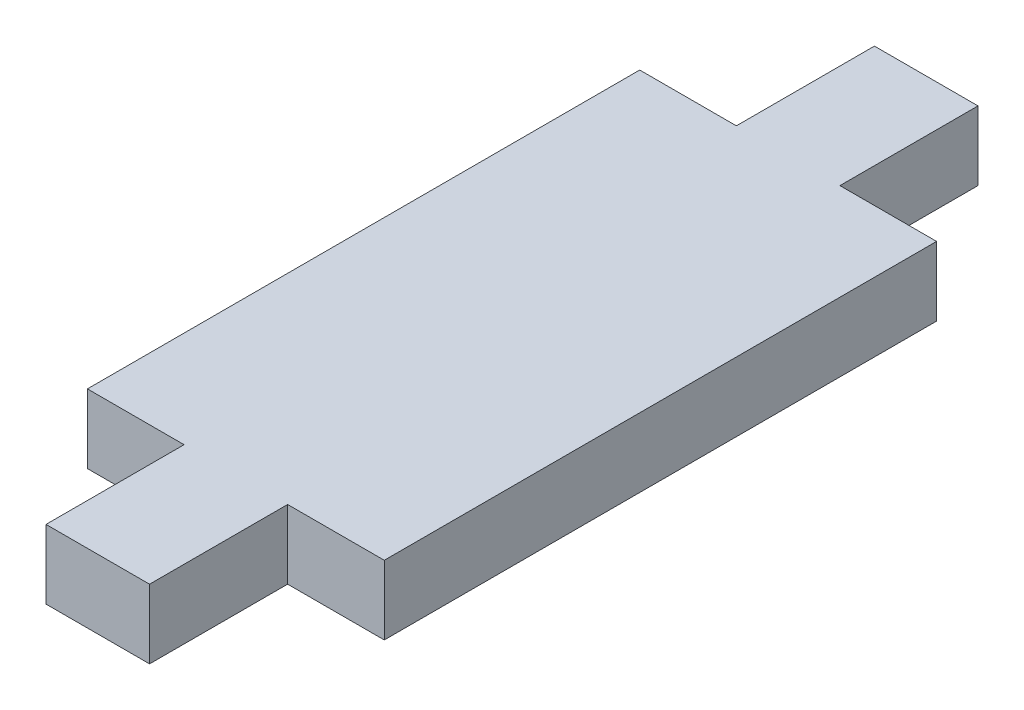
ISO-10303-21;
HEADER;
FILE_DESCRIPTION(('STEP AP214'),'2;1');
FILE_NAME('part.step','',(''),(''),'','','');
FILE_SCHEMA(('AUTOMOTIVE_DESIGN { 1 0 10303 214 1 1 1 1 }'));
ENDSEC;
DATA;
#1=APPLICATION_CONTEXT('core data for automotive mechanical design processes');
#2=APPLICATION_PROTOCOL_DEFINITION('international standard','automotive_design',2000,#1);
#3=PRODUCT_CONTEXT('',#1,'mechanical');
#4=PRODUCT('Part','Part','',(#3));
#5=PRODUCT_RELATED_PRODUCT_CATEGORY('part','',(#4));
#6=PRODUCT_DEFINITION_FORMATION('','',#4);
#7=PRODUCT_DEFINITION_CONTEXT('part definition',#1,'design');
#8=PRODUCT_DEFINITION('design','',#6,#7);
#9=PRODUCT_DEFINITION_SHAPE('','',#8);
#10=(LENGTH_UNIT() NAMED_UNIT(*) SI_UNIT(.MILLI.,.METRE.));
#11=(NAMED_UNIT(*) PLANE_ANGLE_UNIT() SI_UNIT($,.RADIAN.));
#12=(NAMED_UNIT(*) SI_UNIT($,.STERADIAN.) SOLID_ANGLE_UNIT());
#13=UNCERTAINTY_MEASURE_WITH_UNIT(LENGTH_MEASURE(1.E-05),#10,'distance_accuracy_value','');
#14=(GEOMETRIC_REPRESENTATION_CONTEXT(3) GLOBAL_UNCERTAINTY_ASSIGNED_CONTEXT((#13)) GLOBAL_UNIT_ASSIGNED_CONTEXT((#10,
#11,#12)) REPRESENTATION_CONTEXT('',''));
#15=CARTESIAN_POINT('',(0.,0.,0.));
#16=DIRECTION('',(0.,0.,1.));
#17=DIRECTION('',(1.,0.,0.));
#18=AXIS2_PLACEMENT_3D('',#15,#16,#17);
#19=CARTESIAN_POINT('',(3.75,5.,20.));
#20=DIRECTION('',(0.,0.,-1.));
#21=DIRECTION('',(-1.,0.,0.));
#22=AXIS2_PLACEMENT_3D('',#19,#20,#21);
#23=PLANE('',#22);
#24=DIRECTION('',(1.,0.,0.));
#25=VECTOR('',#24,1.);
#26=CARTESIAN_POINT('',(3.75,0.,20.));
#27=LINE('',#26,#25);
#28=CARTESIAN_POINT('',(3.75,0.,20.));
#29=VERTEX_POINT('',#28);
#30=CARTESIAN_POINT('',(10.75,0.,20.));
#31=VERTEX_POINT('',#30);
#32=EDGE_CURVE('E164',#29,#31,#27,.T.);
#33=ORIENTED_EDGE('',*,*,#32,.T.);
#34=DIRECTION('',(0.,-1.,0.));
#35=VECTOR('',#34,1.);
#36=CARTESIAN_POINT('',(10.75,5.,20.));
#37=LINE('',#36,#35);
#38=CARTESIAN_POINT('',(10.75,5.,20.));
#39=VERTEX_POINT('',#38);
#40=EDGE_CURVE('E11',#39,#31,#37,.T.);
#41=ORIENTED_EDGE('',*,*,#40,.F.);
#42=DIRECTION('',(1.,0.,0.));
#43=VECTOR('',#42,1.);
#44=CARTESIAN_POINT('',(3.75,5.,20.));
#45=LINE('',#44,#43);
#46=CARTESIAN_POINT('',(3.75,5.,20.));
#47=VERTEX_POINT('',#46);
#48=EDGE_CURVE('E198',#47,#39,#45,.T.);
#49=ORIENTED_EDGE('',*,*,#48,.F.);
#50=DIRECTION('',(0.,-1.,0.));
#51=VECTOR('',#50,1.);
#52=CARTESIAN_POINT('',(3.75,5.,20.));
#53=LINE('',#52,#51);
#54=EDGE_CURVE('E160',#47,#29,#53,.T.);
#55=ORIENTED_EDGE('',*,*,#54,.T.);
#56=EDGE_LOOP('',(#33,#41,#49,#55));
#57=FACE_BOUND('',#56,.T.);
#58=ADVANCED_FACE('F39',(#57),#23,.F.);
#59=CARTESIAN_POINT('',(10.75,5.,-20.));
#60=DIRECTION('',(-1.,0.,0.));
#61=DIRECTION('',(0.,0.,1.));
#62=AXIS2_PLACEMENT_3D('',#59,#60,#61);
#63=PLANE('',#62);
#64=DIRECTION('',(0.,0.,-1.));
#65=VECTOR('',#64,1.);
#66=CARTESIAN_POINT('',(10.75,0.,-20.));
#67=LINE('',#66,#65);
#68=CARTESIAN_POINT('',(10.75,0.,-20.));
#69=VERTEX_POINT('',#68);
#70=EDGE_CURVE('E168',#31,#69,#67,.T.);
#71=ORIENTED_EDGE('',*,*,#70,.T.);
#72=DIRECTION('',(0.,-1.,0.));
#73=VECTOR('',#72,1.);
#74=CARTESIAN_POINT('',(10.75,5.,-20.));
#75=LINE('',#74,#73);
#76=CARTESIAN_POINT('',(10.75,5.,-20.));
#77=VERTEX_POINT('',#76);
#78=EDGE_CURVE('E48',#77,#69,#75,.T.);
#79=ORIENTED_EDGE('',*,*,#78,.F.);
#80=DIRECTION('',(0.,0.,-1.));
#81=VECTOR('',#80,1.);
#82=CARTESIAN_POINT('',(10.75,5.,-20.));
#83=LINE('',#82,#81);
#84=EDGE_CURVE('E111',#39,#77,#83,.T.);
#85=ORIENTED_EDGE('',*,*,#84,.F.);
#86=ORIENTED_EDGE('',*,*,#40,.T.);
#87=EDGE_LOOP('',(#71,#79,#85,#86));
#88=FACE_BOUND('',#87,.T.);
#89=ADVANCED_FACE('F292',(#88),#63,.F.);
#90=CARTESIAN_POINT('',(3.75,5.,-20.));
#91=DIRECTION('',(0.,0.,1.));
#92=DIRECTION('',(1.,0.,0.));
#93=AXIS2_PLACEMENT_3D('',#90,#91,#92);
#94=PLANE('',#93);
#95=DIRECTION('',(-1.,0.,0.));
#96=VECTOR('',#95,1.);
#97=CARTESIAN_POINT('',(3.75,0.,-20.));
#98=LINE('',#97,#96);
#99=CARTESIAN_POINT('',(3.75,0.,-20.));
#100=VERTEX_POINT('',#99);
#101=EDGE_CURVE('E171',#69,#100,#98,.T.);
#102=ORIENTED_EDGE('',*,*,#101,.T.);
#103=DIRECTION('',(0.,-1.,0.));
#104=VECTOR('',#103,1.);
#105=CARTESIAN_POINT('',(3.75,5.,-20.));
#106=LINE('',#105,#104);
#107=CARTESIAN_POINT('',(3.75,5.,-20.));
#108=VERTEX_POINT('',#107);
#109=EDGE_CURVE('E225',#108,#100,#106,.T.);
#110=ORIENTED_EDGE('',*,*,#109,.F.);
#111=DIRECTION('',(-1.,0.,0.));
#112=VECTOR('',#111,1.);
#113=CARTESIAN_POINT('',(3.75,5.,-20.));
#114=LINE('',#113,#112);
#115=EDGE_CURVE('E235',#77,#108,#114,.T.);
#116=ORIENTED_EDGE('',*,*,#115,.F.);
#117=ORIENTED_EDGE('',*,*,#78,.T.);
#118=EDGE_LOOP('',(#102,#110,#116,#117));
#119=FACE_BOUND('',#118,.T.);
#120=ADVANCED_FACE('F233',(#119),#94,.F.);
#121=CARTESIAN_POINT('',(3.75,5.,-30.));
#122=DIRECTION('',(-1.,0.,0.));
#123=DIRECTION('',(0.,0.,1.));
#124=AXIS2_PLACEMENT_3D('',#121,#122,#123);
#125=PLANE('',#124);
#126=DIRECTION('',(0.,0.,-1.));
#127=VECTOR('',#126,1.);
#128=CARTESIAN_POINT('',(3.75,0.,-30.));
#129=LINE('',#128,#127);
#130=CARTESIAN_POINT('',(3.75,0.,-30.));
#131=VERTEX_POINT('',#130);
#132=EDGE_CURVE('E174',#100,#131,#129,.T.);
#133=ORIENTED_EDGE('',*,*,#132,.T.);
#134=DIRECTION('',(0.,-1.,0.));
#135=VECTOR('',#134,1.);
#136=CARTESIAN_POINT('',(3.75,5.,-30.));
#137=LINE('',#136,#135);
#138=CARTESIAN_POINT('',(3.75,5.,-30.));
#139=VERTEX_POINT('',#138);
#140=EDGE_CURVE('E221',#139,#131,#137,.T.);
#141=ORIENTED_EDGE('',*,*,#140,.F.);
#142=DIRECTION('',(0.,0.,-1.));
#143=VECTOR('',#142,1.);
#144=CARTESIAN_POINT('',(3.75,5.,-30.));
#145=LINE('',#144,#143);
#146=EDGE_CURVE('E254',#108,#139,#145,.T.);
#147=ORIENTED_EDGE('',*,*,#146,.F.);
#148=ORIENTED_EDGE('',*,*,#109,.T.);
#149=EDGE_LOOP('',(#133,#141,#147,#148));
#150=FACE_BOUND('',#149,.T.);
#151=ADVANCED_FACE('F244',(#150),#125,.F.);
#152=CARTESIAN_POINT('',(-3.75,5.,-30.));
#153=DIRECTION('',(0.,0.,1.));
#154=DIRECTION('',(1.,0.,0.));
#155=AXIS2_PLACEMENT_3D('',#152,#153,#154);
#156=PLANE('',#155);
#157=DIRECTION('',(-1.,0.,0.));
#158=VECTOR('',#157,1.);
#159=CARTESIAN_POINT('',(-3.75,0.,-30.));
#160=LINE('',#159,#158);
#161=CARTESIAN_POINT('',(-3.75,0.,-30.));
#162=VERTEX_POINT('',#161);
#163=EDGE_CURVE('E177',#131,#162,#160,.T.);
#164=ORIENTED_EDGE('',*,*,#163,.T.);
#165=DIRECTION('',(0.,-1.,0.));
#166=VECTOR('',#165,1.);
#167=CARTESIAN_POINT('',(-3.75,5.,-30.));
#168=LINE('',#167,#166);
#169=CARTESIAN_POINT('',(-3.75,5.,-30.));
#170=VERTEX_POINT('',#169);
#171=EDGE_CURVE('E217',#170,#162,#168,.T.);
#172=ORIENTED_EDGE('',*,*,#171,.F.);
#173=DIRECTION('',(-1.,0.,0.));
#174=VECTOR('',#173,1.);
#175=CARTESIAN_POINT('',(-3.75,5.,-30.));
#176=LINE('',#175,#174);
#177=EDGE_CURVE('E250',#139,#170,#176,.T.);
#178=ORIENTED_EDGE('',*,*,#177,.F.);
#179=ORIENTED_EDGE('',*,*,#140,.T.);
#180=EDGE_LOOP('',(#164,#172,#178,#179));
#181=FACE_BOUND('',#180,.T.);
#182=ADVANCED_FACE('F248',(#181),#156,.F.);
#183=CARTESIAN_POINT('',(-3.75,5.,-30.));
#184=DIRECTION('',(1.,0.,0.));
#185=DIRECTION('',(0.,0.,-1.));
#186=AXIS2_PLACEMENT_3D('',#183,#184,#185);
#187=PLANE('',#186);
#188=DIRECTION('',(0.,0.,1.));
#189=VECTOR('',#188,1.);
#190=CARTESIAN_POINT('',(-3.75,0.,-30.));
#191=LINE('',#190,#189);
#192=CARTESIAN_POINT('',(-3.75,0.,-20.));
#193=VERTEX_POINT('',#192);
#194=EDGE_CURVE('E180',#162,#193,#191,.T.);
#195=ORIENTED_EDGE('',*,*,#194,.T.);
#196=DIRECTION('',(0.,-1.,0.));
#197=VECTOR('',#196,1.);
#198=CARTESIAN_POINT('',(-3.75,5.,-20.));
#199=LINE('',#198,#197);
#200=CARTESIAN_POINT('',(-3.75,5.,-20.));
#201=VERTEX_POINT('',#200);
#202=EDGE_CURVE('E213',#201,#193,#199,.T.);
#203=ORIENTED_EDGE('',*,*,#202,.F.);
#204=DIRECTION('',(0.,0.,1.));
#205=VECTOR('',#204,1.);
#206=CARTESIAN_POINT('',(-3.75,5.,-30.));
#207=LINE('',#206,#205);
#208=EDGE_CURVE('E253',#170,#201,#207,.T.);
#209=ORIENTED_EDGE('',*,*,#208,.F.);
#210=ORIENTED_EDGE('',*,*,#171,.T.);
#211=EDGE_LOOP('',(#195,#203,#209,#210));
#212=FACE_BOUND('',#211,.T.);
#213=ADVANCED_FACE('F305',(#212),#187,.F.);
#214=CARTESIAN_POINT('',(-10.75,5.,-20.));
#215=DIRECTION('',(0.,0.,1.));
#216=DIRECTION('',(1.,0.,0.));
#217=AXIS2_PLACEMENT_3D('',#214,#215,#216);
#218=PLANE('',#217);
#219=DIRECTION('',(-1.,0.,0.));
#220=VECTOR('',#219,1.);
#221=CARTESIAN_POINT('',(-10.75,0.,-20.));
#222=LINE('',#221,#220);
#223=CARTESIAN_POINT('',(-10.75,0.,-20.));
#224=VERTEX_POINT('',#223);
#225=EDGE_CURVE('E183',#193,#224,#222,.T.);
#226=ORIENTED_EDGE('',*,*,#225,.T.);
#227=DIRECTION('',(0.,-1.,0.));
#228=VECTOR('',#227,1.);
#229=CARTESIAN_POINT('',(-10.75,5.,-20.));
#230=LINE('',#229,#228);
#231=CARTESIAN_POINT('',(-10.75,5.,-20.));
#232=VERTEX_POINT('',#231);
#233=EDGE_CURVE('E209',#232,#224,#230,.T.);
#234=ORIENTED_EDGE('',*,*,#233,.F.);
#235=DIRECTION('',(-1.,0.,0.));
#236=VECTOR('',#235,1.);
#237=CARTESIAN_POINT('',(-10.75,5.,-20.));
#238=LINE('',#237,#236);
#239=EDGE_CURVE('E258',#201,#232,#238,.T.);
#240=ORIENTED_EDGE('',*,*,#239,.F.);
#241=ORIENTED_EDGE('',*,*,#202,.T.);
#242=EDGE_LOOP('',(#226,#234,#240,#241));
#243=FACE_BOUND('',#242,.T.);
#244=ADVANCED_FACE('F308',(#243),#218,.F.);
#245=CARTESIAN_POINT('',(-10.75,5.,-20.));
#246=DIRECTION('',(1.,0.,0.));
#247=DIRECTION('',(0.,0.,-1.));
#248=AXIS2_PLACEMENT_3D('',#245,#246,#247);
#249=PLANE('',#248);
#250=DIRECTION('',(0.,0.,1.));
#251=VECTOR('',#250,1.);
#252=CARTESIAN_POINT('',(-10.75,0.,-20.));
#253=LINE('',#252,#251);
#254=CARTESIAN_POINT('',(-10.75,0.,20.));
#255=VERTEX_POINT('',#254);
#256=EDGE_CURVE('E186',#224,#255,#253,.T.);
#257=ORIENTED_EDGE('',*,*,#256,.T.);
#258=DIRECTION('',(0.,-1.,0.));
#259=VECTOR('',#258,1.);
#260=CARTESIAN_POINT('',(-10.75,5.,20.));
#261=LINE('',#260,#259);
#262=CARTESIAN_POINT('',(-10.75,5.,20.));
#263=VERTEX_POINT('',#262);
#264=EDGE_CURVE('E205',#263,#255,#261,.T.);
#265=ORIENTED_EDGE('',*,*,#264,.F.);
#266=DIRECTION('',(0.,0.,1.));
#267=VECTOR('',#266,1.);
#268=CARTESIAN_POINT('',(-10.75,5.,-20.));
#269=LINE('',#268,#267);
#270=EDGE_CURVE('E265',#232,#263,#269,.T.);
#271=ORIENTED_EDGE('',*,*,#270,.F.);
#272=ORIENTED_EDGE('',*,*,#233,.T.);
#273=EDGE_LOOP('',(#257,#265,#271,#272));
#274=FACE_BOUND('',#273,.T.);
#275=ADVANCED_FACE('F273',(#274),#249,.F.);
#276=CARTESIAN_POINT('',(-10.75,5.,20.));
#277=DIRECTION('',(0.,0.,-1.));
#278=DIRECTION('',(-1.,0.,0.));
#279=AXIS2_PLACEMENT_3D('',#276,#277,#278);
#280=PLANE('',#279);
#281=DIRECTION('',(1.,0.,0.));
#282=VECTOR('',#281,1.);
#283=CARTESIAN_POINT('',(-10.75,0.,20.));
#284=LINE('',#283,#282);
#285=CARTESIAN_POINT('',(-3.75,0.,20.));
#286=VERTEX_POINT('',#285);
#287=EDGE_CURVE('E189',#255,#286,#284,.T.);
#288=ORIENTED_EDGE('',*,*,#287,.T.);
#289=DIRECTION('',(0.,-1.,0.));
#290=VECTOR('',#289,1.);
#291=CARTESIAN_POINT('',(-3.75,5.,20.));
#292=LINE('',#291,#290);
#293=CARTESIAN_POINT('',(-3.75,5.,20.));
#294=VERTEX_POINT('',#293);
#295=EDGE_CURVE('E153',#294,#286,#292,.T.);
#296=ORIENTED_EDGE('',*,*,#295,.F.);
#297=DIRECTION('',(1.,0.,0.));
#298=VECTOR('',#297,1.);
#299=CARTESIAN_POINT('',(-10.75,5.,20.));
#300=LINE('',#299,#298);
#301=EDGE_CURVE('E142',#263,#294,#300,.T.);
#302=ORIENTED_EDGE('',*,*,#301,.F.);
#303=ORIENTED_EDGE('',*,*,#264,.T.);
#304=EDGE_LOOP('',(#288,#296,#302,#303));
#305=FACE_BOUND('',#304,.T.);
#306=ADVANCED_FACE('F277',(#305),#280,.F.);
#307=CARTESIAN_POINT('',(-3.75,5.,30.));
#308=DIRECTION('',(1.,0.,0.));
#309=DIRECTION('',(0.,0.,-1.));
#310=AXIS2_PLACEMENT_3D('',#307,#308,#309);
#311=PLANE('',#310);
#312=DIRECTION('',(0.,0.,1.));
#313=VECTOR('',#312,1.);
#314=CARTESIAN_POINT('',(-3.75,0.,30.));
#315=LINE('',#314,#313);
#316=CARTESIAN_POINT('',(-3.75,0.,30.));
#317=VERTEX_POINT('',#316);
#318=EDGE_CURVE('E151',#286,#317,#315,.T.);
#319=ORIENTED_EDGE('',*,*,#318,.T.);
#320=DIRECTION('',(0.,-1.,0.));
#321=VECTOR('',#320,1.);
#322=CARTESIAN_POINT('',(-3.75,5.,30.));
#323=LINE('',#322,#321);
#324=CARTESIAN_POINT('',(-3.75,5.,30.));
#325=VERTEX_POINT('',#324);
#326=EDGE_CURVE('E148',#325,#317,#323,.T.);
#327=ORIENTED_EDGE('',*,*,#326,.F.);
#328=DIRECTION('',(0.,0.,1.));
#329=VECTOR('',#328,1.);
#330=CARTESIAN_POINT('',(-3.75,5.,30.));
#331=LINE('',#330,#329);
#332=EDGE_CURVE('E136',#294,#325,#331,.T.);
#333=ORIENTED_EDGE('',*,*,#332,.F.);
#334=ORIENTED_EDGE('',*,*,#295,.T.);
#335=EDGE_LOOP('',(#319,#327,#333,#334));
#336=FACE_BOUND('',#335,.T.);
#337=ADVANCED_FACE('F149',(#336),#311,.F.);
#338=CARTESIAN_POINT('',(-3.75,5.,30.));
#339=DIRECTION('',(0.,0.,-1.));
#340=DIRECTION('',(-1.,0.,0.));
#341=AXIS2_PLACEMENT_3D('',#338,#339,#340);
#342=PLANE('',#341);
#343=DIRECTION('',(1.,0.,0.));
#344=VECTOR('',#343,1.);
#345=CARTESIAN_POINT('',(-3.75,0.,30.));
#346=LINE('',#345,#344);
#347=CARTESIAN_POINT('',(3.75,0.,30.));
#348=VERTEX_POINT('',#347);
#349=EDGE_CURVE('E97',#317,#348,#346,.T.);
#350=ORIENTED_EDGE('',*,*,#349,.T.);
#351=DIRECTION('',(0.,-1.,0.));
#352=VECTOR('',#351,1.);
#353=CARTESIAN_POINT('',(3.75,5.,30.));
#354=LINE('',#353,#352);
#355=CARTESIAN_POINT('',(3.75,5.,30.));
#356=VERTEX_POINT('',#355);
#357=EDGE_CURVE('E154',#356,#348,#354,.T.);
#358=ORIENTED_EDGE('',*,*,#357,.F.);
#359=DIRECTION('',(1.,0.,0.));
#360=VECTOR('',#359,1.);
#361=CARTESIAN_POINT('',(-3.75,5.,30.));
#362=LINE('',#361,#360);
#363=EDGE_CURVE('E140',#325,#356,#362,.T.);
#364=ORIENTED_EDGE('',*,*,#363,.F.);
#365=ORIENTED_EDGE('',*,*,#326,.T.);
#366=EDGE_LOOP('',(#350,#358,#364,#365));
#367=FACE_BOUND('',#366,.T.);
#368=ADVANCED_FACE('F156',(#367),#342,.F.);
#369=CARTESIAN_POINT('',(3.75,5.,30.));
#370=DIRECTION('',(-1.,0.,0.));
#371=DIRECTION('',(0.,0.,1.));
#372=AXIS2_PLACEMENT_3D('',#369,#370,#371);
#373=PLANE('',#372);
#374=DIRECTION('',(0.,0.,-1.));
#375=VECTOR('',#374,1.);
#376=CARTESIAN_POINT('',(3.75,0.,30.));
#377=LINE('',#376,#375);
#378=EDGE_CURVE('E103',#348,#29,#377,.T.);
#379=ORIENTED_EDGE('',*,*,#378,.T.);
#380=ORIENTED_EDGE('',*,*,#54,.F.);
#381=DIRECTION('',(0.,0.,-1.));
#382=VECTOR('',#381,1.);
#383=CARTESIAN_POINT('',(3.75,5.,30.));
#384=LINE('',#383,#382);
#385=EDGE_CURVE('E56',#356,#47,#384,.T.);
#386=ORIENTED_EDGE('',*,*,#385,.F.);
#387=ORIENTED_EDGE('',*,*,#357,.T.);
#388=EDGE_LOOP('',(#379,#380,#386,#387));
#389=FACE_BOUND('',#388,.T.);
#390=ADVANCED_FACE('F281',(#389),#373,.F.);
#391=CARTESIAN_POINT('',(0.,5.,0.));
#392=DIRECTION('',(0.,-1.,0.));
#393=DIRECTION('',(0.,0.,-1.));
#394=AXIS2_PLACEMENT_3D('',#391,#392,#393);
#395=PLANE('',#394);
#396=ORIENTED_EDGE('',*,*,#48,.T.);
#397=ORIENTED_EDGE('',*,*,#84,.T.);
#398=ORIENTED_EDGE('',*,*,#115,.T.);
#399=ORIENTED_EDGE('',*,*,#146,.T.);
#400=ORIENTED_EDGE('',*,*,#177,.T.);
#401=ORIENTED_EDGE('',*,*,#208,.T.);
#402=ORIENTED_EDGE('',*,*,#239,.T.);
#403=ORIENTED_EDGE('',*,*,#270,.T.);
#404=ORIENTED_EDGE('',*,*,#301,.T.);
#405=ORIENTED_EDGE('',*,*,#332,.T.);
#406=ORIENTED_EDGE('',*,*,#363,.T.);
#407=ORIENTED_EDGE('',*,*,#385,.T.);
#408=EDGE_LOOP('',(#396,#397,#398,#399,#400,#401,#402,#403,#404,#405,#406,#407));
#409=FACE_BOUND('',#408,.T.);
#410=ADVANCED_FACE('F138',(#409),#395,.F.);
#411=CARTESIAN_POINT('',(0.,0.,0.));
#412=DIRECTION('',(0.,-1.,0.));
#413=DIRECTION('',(0.,0.,-1.));
#414=AXIS2_PLACEMENT_3D('',#411,#412,#413);
#415=PLANE('',#414);
#416=ORIENTED_EDGE('',*,*,#32,.F.);
#417=ORIENTED_EDGE('',*,*,#378,.F.);
#418=ORIENTED_EDGE('',*,*,#349,.F.);
#419=ORIENTED_EDGE('',*,*,#318,.F.);
#420=ORIENTED_EDGE('',*,*,#287,.F.);
#421=ORIENTED_EDGE('',*,*,#256,.F.);
#422=ORIENTED_EDGE('',*,*,#225,.F.);
#423=ORIENTED_EDGE('',*,*,#194,.F.);
#424=ORIENTED_EDGE('',*,*,#163,.F.);
#425=ORIENTED_EDGE('',*,*,#132,.F.);
#426=ORIENTED_EDGE('',*,*,#101,.F.);
#427=ORIENTED_EDGE('',*,*,#70,.F.);
#428=EDGE_LOOP('',(#416,#417,#418,#419,#420,#421,#422,#423,#424,#425,#426,#427));
#429=FACE_BOUND('',#428,.T.);
#430=ADVANCED_FACE('F239',(#429),#415,.T.);
#431=CLOSED_SHELL('',(#58,#89,#120,#151,#182,#213,#244,#275,#306,#337,#368,#390,#410,#430));
#432=MANIFOLD_SOLID_BREP('B2',#431);
#433=ADVANCED_BREP_SHAPE_REPRESENTATION('',(#18,#432),#14);
#434=SHAPE_DEFINITION_REPRESENTATION(#9,#433);
ENDSEC;
END-ISO-10303-21;
